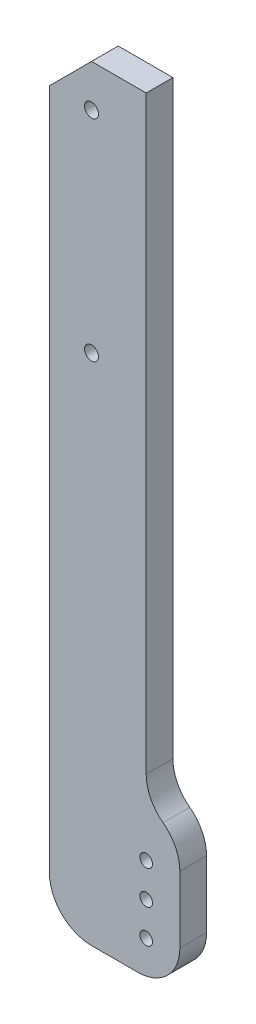
ISO-10303-21;
HEADER;
FILE_DESCRIPTION(('STEP AP214'),'2;1');
FILE_NAME('part.step','',(''),(''),'','','');
FILE_SCHEMA(('AUTOMOTIVE_DESIGN { 1 0 10303 214 1 1 1 1 }'));
ENDSEC;
DATA;
#1=APPLICATION_CONTEXT('core data for automotive mechanical design processes');
#2=APPLICATION_PROTOCOL_DEFINITION('international standard','automotive_design',2000,#1);
#3=PRODUCT_CONTEXT('',#1,'mechanical');
#4=PRODUCT('Part','Part','',(#3));
#5=PRODUCT_RELATED_PRODUCT_CATEGORY('part','',(#4));
#6=PRODUCT_DEFINITION_FORMATION('','',#4);
#7=PRODUCT_DEFINITION_CONTEXT('part definition',#1,'design');
#8=PRODUCT_DEFINITION('design','',#6,#7);
#9=PRODUCT_DEFINITION_SHAPE('','',#8);
#10=(LENGTH_UNIT() NAMED_UNIT(*) SI_UNIT(.MILLI.,.METRE.));
#11=(NAMED_UNIT(*) PLANE_ANGLE_UNIT() SI_UNIT($,.RADIAN.));
#12=(NAMED_UNIT(*) SI_UNIT($,.STERADIAN.) SOLID_ANGLE_UNIT());
#13=UNCERTAINTY_MEASURE_WITH_UNIT(LENGTH_MEASURE(1.E-05),#10,'distance_accuracy_value','');
#14=(GEOMETRIC_REPRESENTATION_CONTEXT(3) GLOBAL_UNCERTAINTY_ASSIGNED_CONTEXT((#13)) GLOBAL_UNIT_ASSIGNED_CONTEXT((#10,
#11,#12)) REPRESENTATION_CONTEXT('',''));
#15=CARTESIAN_POINT('',(0.,0.,0.));
#16=DIRECTION('',(0.,0.,1.));
#17=DIRECTION('',(1.,0.,0.));
#18=AXIS2_PLACEMENT_3D('',#15,#16,#17);
#19=CARTESIAN_POINT('',(8.,0.,6.35));
#20=DIRECTION('',(1.,0.,0.));
#21=DIRECTION('',(0.,0.,-1.));
#22=AXIS2_PLACEMENT_3D('',#19,#20,#21);
#23=PLANE('',#22);
#24=DIRECTION('',(0.,-1.,0.));
#25=VECTOR('',#24,1.);
#26=CARTESIAN_POINT('',(8.,0.,0.));
#27=LINE('',#26,#25);
#28=CARTESIAN_POINT('',(8.,9.79795897113271,0.));
#29=VERTEX_POINT('',#28);
#30=CARTESIAN_POINT('',(8.,-6.,0.));
#31=VERTEX_POINT('',#30);
#32=EDGE_CURVE('E254',#29,#31,#27,.T.);
#33=ORIENTED_EDGE('',*,*,#32,.F.);
#34=DIRECTION('',(0.,0.,1.));
#35=VECTOR('',#34,1.);
#36=CARTESIAN_POINT('',(8.,9.79795897113271,6.35));
#37=LINE('',#36,#35);
#38=CARTESIAN_POINT('',(8.,9.79795897113271,6.35));
#39=VERTEX_POINT('',#38);
#40=EDGE_CURVE('E194',#29,#39,#37,.T.);
#41=ORIENTED_EDGE('',*,*,#40,.T.);
#42=DIRECTION('',(0.,-1.,0.));
#43=VECTOR('',#42,1.);
#44=CARTESIAN_POINT('',(8.,0.,6.35));
#45=LINE('',#44,#43);
#46=CARTESIAN_POINT('',(8.,-6.,6.35));
#47=VERTEX_POINT('',#46);
#48=EDGE_CURVE('E130',#39,#47,#45,.T.);
#49=ORIENTED_EDGE('',*,*,#48,.T.);
#50=DIRECTION('',(0.,0.,-1.));
#51=VECTOR('',#50,1.);
#52=CARTESIAN_POINT('',(8.,-6.,0.));
#53=LINE('',#52,#51);
#54=EDGE_CURVE('E142',#47,#31,#53,.T.);
#55=ORIENTED_EDGE('',*,*,#54,.T.);
#56=EDGE_LOOP('',(#33,#41,#49,#55));
#57=FACE_BOUND('',#56,.T.);
#58=ADVANCED_FACE('F40',(#57),#23,.T.);
#59=CARTESIAN_POINT('',(0.,0.,6.35));
#60=DIRECTION('',(-1.,0.,0.));
#61=DIRECTION('',(0.,0.,1.));
#62=AXIS2_PLACEMENT_3D('',#59,#60,#61);
#63=PLANE('',#62);
#64=DIRECTION('',(0.,1.,0.));
#65=VECTOR('',#64,1.);
#66=CARTESIAN_POINT('',(0.,0.,6.35));
#67=LINE('',#66,#65);
#68=CARTESIAN_POINT('',(0.,25.7979589711327,6.35));
#69=VERTEX_POINT('',#68);
#70=CARTESIAN_POINT('',(0.,166.,6.35));
#71=VERTEX_POINT('',#70);
#72=EDGE_CURVE('E119',#69,#71,#67,.T.);
#73=ORIENTED_EDGE('',*,*,#72,.F.);
#74=DIRECTION('',(0.,0.,-1.));
#75=VECTOR('',#74,1.);
#76=CARTESIAN_POINT('',(0.,25.7979589711327,6.35));
#77=LINE('',#76,#75);
#78=CARTESIAN_POINT('',(0.,25.7979589711327,0.));
#79=VERTEX_POINT('',#78);
#80=EDGE_CURVE('E178',#69,#79,#77,.T.);
#81=ORIENTED_EDGE('',*,*,#80,.T.);
#82=DIRECTION('',(0.,1.,0.));
#83=VECTOR('',#82,1.);
#84=CARTESIAN_POINT('',(0.,0.,0.));
#85=LINE('',#84,#83);
#86=CARTESIAN_POINT('',(0.,166.,0.));
#87=VERTEX_POINT('',#86);
#88=EDGE_CURVE('E140',#79,#87,#85,.T.);
#89=ORIENTED_EDGE('',*,*,#88,.T.);
#90=DIRECTION('',(0.,0.,-1.));
#91=VECTOR('',#90,1.);
#92=CARTESIAN_POINT('',(0.,166.,6.35));
#93=LINE('',#92,#91);
#94=EDGE_CURVE('E134',#71,#87,#93,.T.);
#95=ORIENTED_EDGE('',*,*,#94,.F.);
#96=EDGE_LOOP('',(#73,#81,#89,#95));
#97=FACE_BOUND('',#96,.T.);
#98=ADVANCED_FACE('F138',(#97),#63,.F.);
#99=CARTESIAN_POINT('',(0.,166.,6.35));
#100=DIRECTION('',(0.,-1.,0.));
#101=DIRECTION('',(0.,0.,-1.));
#102=AXIS2_PLACEMENT_3D('',#99,#100,#101);
#103=PLANE('',#102);
#104=DIRECTION('',(-1.,0.,0.));
#105=VECTOR('',#104,1.);
#106=CARTESIAN_POINT('',(0.,166.,0.));
#107=LINE('',#106,#105);
#108=CARTESIAN_POINT('',(-13.,166.,0.));
#109=VERTEX_POINT('',#108);
#110=EDGE_CURVE('E259',#87,#109,#107,.T.);
#111=ORIENTED_EDGE('',*,*,#110,.T.);
#112=DIRECTION('',(0.,0.,1.));
#113=VECTOR('',#112,1.);
#114=CARTESIAN_POINT('',(-13.,166.,6.35));
#115=LINE('',#114,#113);
#116=CARTESIAN_POINT('',(-13.,166.,6.35));
#117=VERTEX_POINT('',#116);
#118=EDGE_CURVE('E50',#109,#117,#115,.T.);
#119=ORIENTED_EDGE('',*,*,#118,.T.);
#120=DIRECTION('',(-1.,0.,0.));
#121=VECTOR('',#120,1.);
#122=CARTESIAN_POINT('',(0.,166.,6.35));
#123=LINE('',#122,#121);
#124=EDGE_CURVE('E121',#71,#117,#123,.T.);
#125=ORIENTED_EDGE('',*,*,#124,.F.);
#126=ORIENTED_EDGE('',*,*,#94,.T.);
#127=EDGE_LOOP('',(#111,#119,#125,#126));
#128=FACE_BOUND('',#127,.T.);
#129=ADVANCED_FACE('F133',(#128),#103,.F.);
#130=CARTESIAN_POINT('',(-23.,0.,6.35));
#131=DIRECTION('',(-1.,0.,0.));
#132=DIRECTION('',(0.,0.,1.));
#133=AXIS2_PLACEMENT_3D('',#130,#131,#132);
#134=PLANE('',#133);
#135=DIRECTION('',(0.,1.,0.));
#136=VECTOR('',#135,1.);
#137=CARTESIAN_POINT('',(-23.,0.,6.35));
#138=LINE('',#137,#136);
#139=CARTESIAN_POINT('',(-23.,-5.99999999999999,6.35));
#140=VERTEX_POINT('',#139);
#141=CARTESIAN_POINT('',(-23.,156.,6.35));
#142=VERTEX_POINT('',#141);
#143=EDGE_CURVE('E136',#140,#142,#138,.T.);
#144=ORIENTED_EDGE('',*,*,#143,.T.);
#145=DIRECTION('',(0.,0.,-1.));
#146=VECTOR('',#145,1.);
#147=CARTESIAN_POINT('',(-23.,156.,0.));
#148=LINE('',#147,#146);
#149=CARTESIAN_POINT('',(-23.,156.,0.));
#150=VERTEX_POINT('',#149);
#151=EDGE_CURVE('E200',#142,#150,#148,.T.);
#152=ORIENTED_EDGE('',*,*,#151,.T.);
#153=DIRECTION('',(0.,1.,0.));
#154=VECTOR('',#153,1.);
#155=CARTESIAN_POINT('',(-23.,0.,0.));
#156=LINE('',#155,#154);
#157=CARTESIAN_POINT('',(-23.,-5.99999999999999,0.));
#158=VERTEX_POINT('',#157);
#159=EDGE_CURVE('E261',#158,#150,#156,.T.);
#160=ORIENTED_EDGE('',*,*,#159,.F.);
#161=DIRECTION('',(0.,0.,-1.));
#162=VECTOR('',#161,1.);
#163=CARTESIAN_POINT('',(-23.,-5.99999999999999,6.35));
#164=LINE('',#163,#162);
#165=EDGE_CURVE('E175',#158,#140,#164,.F.);
#166=ORIENTED_EDGE('',*,*,#165,.T.);
#167=EDGE_LOOP('',(#144,#152,#160,#166));
#168=FACE_BOUND('',#167,.T.);
#169=ADVANCED_FACE('F286',(#168),#134,.T.);
#170=CARTESIAN_POINT('',(0.,0.,6.35));
#171=DIRECTION('',(0.,0.,-1.));
#172=DIRECTION('',(-1.,0.,0.));
#173=AXIS2_PLACEMENT_3D('',#170,#171,#172);
#174=CYLINDRICAL_SURFACE('',#173,1.5);
#175=CARTESIAN_POINT('',(0.,0.,6.35));
#176=DIRECTION('',(0.,0.,1.));
#177=DIRECTION('',(1.,0.,0.));
#178=AXIS2_PLACEMENT_3D('',#175,#176,#177);
#179=CIRCLE('',#178,1.5);
#180=CARTESIAN_POINT('',(1.5,0.,6.35));
#181=VERTEX_POINT('',#180);
#182=EDGE_CURVE('E234',#181,#181,#179,.T.);
#183=ORIENTED_EDGE('',*,*,#182,.T.);
#184=EDGE_LOOP('',(#183));
#185=FACE_BOUND('',#184,.T.);
#186=CARTESIAN_POINT('',(0.,0.,0.));
#187=DIRECTION('',(0.,0.,1.));
#188=DIRECTION('',(1.,0.,0.));
#189=AXIS2_PLACEMENT_3D('',#186,#187,#188);
#190=CIRCLE('',#189,1.5);
#191=CARTESIAN_POINT('',(1.5,0.,0.));
#192=VERTEX_POINT('',#191);
#193=EDGE_CURVE('E250',#192,#192,#190,.T.);
#194=ORIENTED_EDGE('',*,*,#193,.F.);
#195=EDGE_LOOP('',(#194));
#196=FACE_BOUND('',#195,.T.);
#197=ADVANCED_FACE('F311',(#185,#196),#174,.F.);
#198=CARTESIAN_POINT('',(0.,8.,6.35));
#199=DIRECTION('',(0.,0.,-1.));
#200=DIRECTION('',(-1.,0.,0.));
#201=AXIS2_PLACEMENT_3D('',#198,#199,#200);
#202=CYLINDRICAL_SURFACE('',#201,1.5);
#203=CARTESIAN_POINT('',(0.,8.,6.35));
#204=DIRECTION('',(0.,0.,1.));
#205=DIRECTION('',(1.,0.,0.));
#206=AXIS2_PLACEMENT_3D('',#203,#204,#205);
#207=CIRCLE('',#206,1.5);
#208=CARTESIAN_POINT('',(1.5,8.,6.35));
#209=VERTEX_POINT('',#208);
#210=EDGE_CURVE('E230',#209,#209,#207,.T.);
#211=ORIENTED_EDGE('',*,*,#210,.T.);
#212=EDGE_LOOP('',(#211));
#213=FACE_BOUND('',#212,.T.);
#214=CARTESIAN_POINT('',(0.,8.,0.));
#215=DIRECTION('',(0.,0.,1.));
#216=DIRECTION('',(1.,0.,0.));
#217=AXIS2_PLACEMENT_3D('',#214,#215,#216);
#218=CIRCLE('',#217,1.5);
#219=CARTESIAN_POINT('',(1.5,8.,0.));
#220=VERTEX_POINT('',#219);
#221=EDGE_CURVE('E246',#220,#220,#218,.T.);
#222=ORIENTED_EDGE('',*,*,#221,.F.);
#223=EDGE_LOOP('',(#222));
#224=FACE_BOUND('',#223,.T.);
#225=ADVANCED_FACE('F314',(#213,#224),#202,.F.);
#226=CARTESIAN_POINT('',(0.,-8.,6.35));
#227=DIRECTION('',(0.,0.,-1.));
#228=DIRECTION('',(-1.,0.,0.));
#229=AXIS2_PLACEMENT_3D('',#226,#227,#228);
#230=CYLINDRICAL_SURFACE('',#229,1.5);
#231=CARTESIAN_POINT('',(0.,-8.,6.35));
#232=DIRECTION('',(0.,0.,1.));
#233=DIRECTION('',(1.,0.,0.));
#234=AXIS2_PLACEMENT_3D('',#231,#232,#233);
#235=CIRCLE('',#234,1.5);
#236=CARTESIAN_POINT('',(1.5,-8.,6.35));
#237=VERTEX_POINT('',#236);
#238=EDGE_CURVE('E226',#237,#237,#235,.T.);
#239=ORIENTED_EDGE('',*,*,#238,.T.);
#240=EDGE_LOOP('',(#239));
#241=FACE_BOUND('',#240,.T.);
#242=CARTESIAN_POINT('',(0.,-8.,0.));
#243=DIRECTION('',(0.,0.,1.));
#244=DIRECTION('',(1.,0.,0.));
#245=AXIS2_PLACEMENT_3D('',#242,#243,#244);
#246=CIRCLE('',#245,1.5);
#247=CARTESIAN_POINT('',(1.5,-8.,0.));
#248=VERTEX_POINT('',#247);
#249=EDGE_CURVE('E216',#248,#248,#246,.T.);
#250=ORIENTED_EDGE('',*,*,#249,.F.);
#251=EDGE_LOOP('',(#250));
#252=FACE_BOUND('',#251,.T.);
#253=ADVANCED_FACE('F318',(#241,#252),#230,.F.);
#254=CARTESIAN_POINT('',(0.,-16.,6.35));
#255=DIRECTION('',(0.,1.,0.));
#256=DIRECTION('',(-1.,0.,0.));
#257=AXIS2_PLACEMENT_3D('',#254,#255,#256);
#258=PLANE('',#257);
#259=DIRECTION('',(1.,0.,0.));
#260=VECTOR('',#259,1.);
#261=CARTESIAN_POINT('',(0.,-16.,0.));
#262=LINE('',#261,#260);
#263=CARTESIAN_POINT('',(-13.,-16.,0.));
#264=VERTEX_POINT('',#263);
#265=CARTESIAN_POINT('',(-2.,-16.,0.));
#266=VERTEX_POINT('',#265);
#267=EDGE_CURVE('E153',#264,#266,#262,.T.);
#268=ORIENTED_EDGE('',*,*,#267,.T.);
#269=DIRECTION('',(0.,0.,-1.));
#270=VECTOR('',#269,1.);
#271=CARTESIAN_POINT('',(-2.,-16.,6.35));
#272=LINE('',#271,#270);
#273=CARTESIAN_POINT('',(-2.,-16.,6.35));
#274=VERTEX_POINT('',#273);
#275=EDGE_CURVE('E165',#266,#274,#272,.F.);
#276=ORIENTED_EDGE('',*,*,#275,.T.);
#277=DIRECTION('',(1.,0.,0.));
#278=VECTOR('',#277,1.);
#279=CARTESIAN_POINT('',(0.,-16.,6.35));
#280=LINE('',#279,#278);
#281=CARTESIAN_POINT('',(-13.,-16.,6.35));
#282=VERTEX_POINT('',#281);
#283=EDGE_CURVE('E143',#282,#274,#280,.T.);
#284=ORIENTED_EDGE('',*,*,#283,.F.);
#285=DIRECTION('',(0.,0.,-1.));
#286=VECTOR('',#285,1.);
#287=CARTESIAN_POINT('',(-13.,-16.,0.));
#288=LINE('',#287,#286);
#289=EDGE_CURVE('E161',#282,#264,#288,.T.);
#290=ORIENTED_EDGE('',*,*,#289,.T.);
#291=EDGE_LOOP('',(#268,#276,#284,#290));
#292=FACE_BOUND('',#291,.T.);
#293=ADVANCED_FACE('F269',(#292),#258,.F.);
#294=CARTESIAN_POINT('',(0.,0.,6.35));
#295=DIRECTION('',(0.,0.,1.));
#296=DIRECTION('',(1.,0.,0.));
#297=AXIS2_PLACEMENT_3D('',#294,#295,#296);
#298=PLANE('',#297);
#299=CARTESIAN_POINT('',(-13.,156.,6.35));
#300=DIRECTION('',(0.,0.,1.));
#301=DIRECTION('',(1.,0.,0.));
#302=AXIS2_PLACEMENT_3D('',#299,#300,#301);
#303=CIRCLE('',#302,1.65000000000002);
#304=CARTESIAN_POINT('',(-11.3499999999999,156.,6.35));
#305=VERTEX_POINT('',#304);
#306=EDGE_CURVE('E210',#305,#305,#303,.T.);
#307=ORIENTED_EDGE('',*,*,#306,.F.);
#308=EDGE_LOOP('',(#307));
#309=FACE_BOUND('',#308,.T.);
#310=CARTESIAN_POINT('',(-13.,106.,6.35));
#311=DIRECTION('',(0.,0.,1.));
#312=DIRECTION('',(1.,0.,0.));
#313=AXIS2_PLACEMENT_3D('',#310,#311,#312);
#314=CIRCLE('',#313,1.65);
#315=CARTESIAN_POINT('',(-11.35,106.,6.35));
#316=VERTEX_POINT('',#315);
#317=EDGE_CURVE('E218',#316,#316,#314,.T.);
#318=ORIENTED_EDGE('',*,*,#317,.F.);
#319=EDGE_LOOP('',(#318));
#320=FACE_BOUND('',#319,.T.);
#321=ORIENTED_EDGE('',*,*,#238,.F.);
#322=EDGE_LOOP('',(#321));
#323=FACE_BOUND('',#322,.T.);
#324=ORIENTED_EDGE('',*,*,#210,.F.);
#325=EDGE_LOOP('',(#324));
#326=FACE_BOUND('',#325,.T.);
#327=ORIENTED_EDGE('',*,*,#182,.F.);
#328=EDGE_LOOP('',(#327));
#329=FACE_BOUND('',#328,.T.);
#330=ORIENTED_EDGE('',*,*,#124,.T.);
#331=DIRECTION('',(-0.707106781186549,-0.707106781186547,0.));
#332=VECTOR('',#331,1.);
#333=CARTESIAN_POINT('',(-89.5,89.5000000000002,6.35));
#334=LINE('',#333,#332);
#335=EDGE_CURVE('E11',#117,#142,#334,.T.);
#336=ORIENTED_EDGE('',*,*,#335,.T.);
#337=ORIENTED_EDGE('',*,*,#143,.F.);
#338=CARTESIAN_POINT('',(-13.,-5.99999999999999,6.35));
#339=DIRECTION('',(0.,0.,1.));
#340=DIRECTION('',(1.,0.,0.));
#341=AXIS2_PLACEMENT_3D('',#338,#339,#340);
#342=CIRCLE('',#341,10.);
#343=EDGE_CURVE('E168',#140,#282,#342,.T.);
#344=ORIENTED_EDGE('',*,*,#343,.T.);
#345=ORIENTED_EDGE('',*,*,#283,.T.);
#346=CARTESIAN_POINT('',(-2.,-6.,6.35));
#347=DIRECTION('',(0.,0.,1.));
#348=DIRECTION('',(1.,0.,0.));
#349=AXIS2_PLACEMENT_3D('',#346,#347,#348);
#350=CIRCLE('',#349,10.);
#351=EDGE_CURVE('E171',#274,#47,#350,.T.);
#352=ORIENTED_EDGE('',*,*,#351,.T.);
#353=ORIENTED_EDGE('',*,*,#48,.F.);
#354=CARTESIAN_POINT('',(-2.,9.79795897113271,6.35));
#355=DIRECTION('',(0.,0.,1.));
#356=DIRECTION('',(1.,0.,0.));
#357=AXIS2_PLACEMENT_3D('',#354,#355,#356);
#358=CIRCLE('',#357,10.);
#359=CARTESIAN_POINT('',(4.,17.7979589711327,6.35));
#360=VERTEX_POINT('',#359);
#361=EDGE_CURVE('E197',#39,#360,#358,.T.);
#362=ORIENTED_EDGE('',*,*,#361,.T.);
#363=CARTESIAN_POINT('',(10.,25.7979589711327,6.35));
#364=DIRECTION('',(0.,0.,1.));
#365=DIRECTION('',(1.,0.,0.));
#366=AXIS2_PLACEMENT_3D('',#363,#364,#365);
#367=CIRCLE('',#366,10.);
#368=EDGE_CURVE('E124',#360,#69,#367,.F.);
#369=ORIENTED_EDGE('',*,*,#368,.T.);
#370=ORIENTED_EDGE('',*,*,#72,.T.);
#371=EDGE_LOOP('',(#330,#336,#337,#344,#345,#352,#353,#362,#369,#370));
#372=FACE_BOUND('',#371,.T.);
#373=ADVANCED_FACE('F120',(#309,#320,#323,#326,#329,#372),#298,.T.);
#374=CARTESIAN_POINT('',(0.,0.,0.));
#375=DIRECTION('',(0.,0.,1.));
#376=DIRECTION('',(1.,0.,0.));
#377=AXIS2_PLACEMENT_3D('',#374,#375,#376);
#378=PLANE('',#377);
#379=CARTESIAN_POINT('',(-13.,156.,0.));
#380=DIRECTION('',(0.,0.,1.));
#381=DIRECTION('',(1.,0.,0.));
#382=AXIS2_PLACEMENT_3D('',#379,#380,#381);
#383=CIRCLE('',#382,1.65000000000002);
#384=CARTESIAN_POINT('',(-11.3499999999999,156.,0.));
#385=VERTEX_POINT('',#384);
#386=EDGE_CURVE('E44',#385,#385,#383,.T.);
#387=ORIENTED_EDGE('',*,*,#386,.T.);
#388=EDGE_LOOP('',(#387));
#389=FACE_BOUND('',#388,.T.);
#390=CARTESIAN_POINT('',(-13.,106.,0.));
#391=DIRECTION('',(0.,0.,1.));
#392=DIRECTION('',(1.,0.,0.));
#393=AXIS2_PLACEMENT_3D('',#390,#391,#392);
#394=CIRCLE('',#393,1.65);
#395=CARTESIAN_POINT('',(-11.35,106.,0.));
#396=VERTEX_POINT('',#395);
#397=EDGE_CURVE('E207',#396,#396,#394,.T.);
#398=ORIENTED_EDGE('',*,*,#397,.T.);
#399=EDGE_LOOP('',(#398));
#400=FACE_BOUND('',#399,.T.);
#401=ORIENTED_EDGE('',*,*,#249,.T.);
#402=EDGE_LOOP('',(#401));
#403=FACE_BOUND('',#402,.T.);
#404=ORIENTED_EDGE('',*,*,#221,.T.);
#405=EDGE_LOOP('',(#404));
#406=FACE_BOUND('',#405,.T.);
#407=ORIENTED_EDGE('',*,*,#193,.T.);
#408=EDGE_LOOP('',(#407));
#409=FACE_BOUND('',#408,.T.);
#410=ORIENTED_EDGE('',*,*,#159,.T.);
#411=DIRECTION('',(0.707106781186549,0.707106781186547,0.));
#412=VECTOR('',#411,1.);
#413=CARTESIAN_POINT('',(-23.,156.,0.));
#414=LINE('',#413,#412);
#415=EDGE_CURVE('E65',#150,#109,#414,.T.);
#416=ORIENTED_EDGE('',*,*,#415,.T.);
#417=ORIENTED_EDGE('',*,*,#110,.F.);
#418=ORIENTED_EDGE('',*,*,#88,.F.);
#419=CARTESIAN_POINT('',(10.,25.7979589711327,0.));
#420=DIRECTION('',(0.,0.,1.));
#421=DIRECTION('',(1.,0.,0.));
#422=AXIS2_PLACEMENT_3D('',#419,#420,#421);
#423=CIRCLE('',#422,10.);
#424=CARTESIAN_POINT('',(4.,17.7979589711327,0.));
#425=VERTEX_POINT('',#424);
#426=EDGE_CURVE('E181',#79,#425,#423,.T.);
#427=ORIENTED_EDGE('',*,*,#426,.T.);
#428=CARTESIAN_POINT('',(-2.,9.79795897113271,0.));
#429=DIRECTION('',(0.,0.,1.));
#430=DIRECTION('',(1.,0.,0.));
#431=AXIS2_PLACEMENT_3D('',#428,#429,#430);
#432=CIRCLE('',#431,10.);
#433=EDGE_CURVE('E191',#425,#29,#432,.F.);
#434=ORIENTED_EDGE('',*,*,#433,.T.);
#435=ORIENTED_EDGE('',*,*,#32,.T.);
#436=CARTESIAN_POINT('',(-2.,-6.,0.));
#437=DIRECTION('',(0.,0.,1.));
#438=DIRECTION('',(1.,0.,0.));
#439=AXIS2_PLACEMENT_3D('',#436,#437,#438);
#440=CIRCLE('',#439,10.);
#441=EDGE_CURVE('E158',#31,#266,#440,.F.);
#442=ORIENTED_EDGE('',*,*,#441,.T.);
#443=ORIENTED_EDGE('',*,*,#267,.F.);
#444=CARTESIAN_POINT('',(-13.,-5.99999999999999,0.));
#445=DIRECTION('',(0.,0.,1.));
#446=DIRECTION('',(1.,0.,0.));
#447=AXIS2_PLACEMENT_3D('',#444,#445,#446);
#448=CIRCLE('',#447,10.);
#449=EDGE_CURVE('E148',#264,#158,#448,.F.);
#450=ORIENTED_EDGE('',*,*,#449,.T.);
#451=EDGE_LOOP('',(#410,#416,#417,#418,#427,#434,#435,#442,#443,#450));
#452=FACE_BOUND('',#451,.T.);
#453=ADVANCED_FACE('F284',(#389,#400,#403,#406,#409,#452),#378,.F.);
#454=CARTESIAN_POINT('',(-2.,-6.,6.35));
#455=DIRECTION('',(0.,0.,1.));
#456=DIRECTION('',(1.,0.,0.));
#457=AXIS2_PLACEMENT_3D('',#454,#455,#456);
#458=CYLINDRICAL_SURFACE('',#457,10.);
#459=ORIENTED_EDGE('',*,*,#351,.F.);
#460=ORIENTED_EDGE('',*,*,#275,.F.);
#461=ORIENTED_EDGE('',*,*,#441,.F.);
#462=ORIENTED_EDGE('',*,*,#54,.F.);
#463=EDGE_LOOP('',(#459,#460,#461,#462));
#464=FACE_BOUND('',#463,.T.);
#465=ADVANCED_FACE('F275',(#464),#458,.T.);
#466=CARTESIAN_POINT('',(-13.,-5.99999999999999,6.35));
#467=DIRECTION('',(0.,0.,1.));
#468=DIRECTION('',(1.,0.,0.));
#469=AXIS2_PLACEMENT_3D('',#466,#467,#468);
#470=CYLINDRICAL_SURFACE('',#469,10.);
#471=ORIENTED_EDGE('',*,*,#343,.F.);
#472=ORIENTED_EDGE('',*,*,#165,.F.);
#473=ORIENTED_EDGE('',*,*,#449,.F.);
#474=ORIENTED_EDGE('',*,*,#289,.F.);
#475=EDGE_LOOP('',(#471,#472,#473,#474));
#476=FACE_BOUND('',#475,.T.);
#477=ADVANCED_FACE('F282',(#476),#470,.T.);
#478=CARTESIAN_POINT('',(10.,25.7979589711327,6.35));
#479=DIRECTION('',(0.,0.,-1.));
#480=DIRECTION('',(-1.,0.,0.));
#481=AXIS2_PLACEMENT_3D('',#478,#479,#480);
#482=CYLINDRICAL_SURFACE('',#481,10.);
#483=ORIENTED_EDGE('',*,*,#368,.F.);
#484=DIRECTION('',(0.,0.,-1.));
#485=VECTOR('',#484,1.);
#486=CARTESIAN_POINT('',(4.,17.7979589711327,6.35));
#487=LINE('',#486,#485);
#488=EDGE_CURVE('E187',#360,#425,#487,.T.);
#489=ORIENTED_EDGE('',*,*,#488,.T.);
#490=ORIENTED_EDGE('',*,*,#426,.F.);
#491=ORIENTED_EDGE('',*,*,#80,.F.);
#492=EDGE_LOOP('',(#483,#489,#490,#491));
#493=FACE_BOUND('',#492,.T.);
#494=ADVANCED_FACE('F299',(#493),#482,.F.);
#495=CARTESIAN_POINT('',(-2.,9.79795897113271,6.35));
#496=DIRECTION('',(0.,0.,-1.));
#497=DIRECTION('',(-1.,0.,0.));
#498=AXIS2_PLACEMENT_3D('',#495,#496,#497);
#499=CYLINDRICAL_SURFACE('',#498,10.);
#500=ORIENTED_EDGE('',*,*,#361,.F.);
#501=ORIENTED_EDGE('',*,*,#40,.F.);
#502=ORIENTED_EDGE('',*,*,#433,.F.);
#503=ORIENTED_EDGE('',*,*,#488,.F.);
#504=EDGE_LOOP('',(#500,#501,#502,#503));
#505=FACE_BOUND('',#504,.T.);
#506=ADVANCED_FACE('F291',(#505),#499,.T.);
#507=CARTESIAN_POINT('',(-23.,156.,6.35));
#508=DIRECTION('',(-0.707106781186547,0.707106781186549,0.));
#509=DIRECTION('',(0.,0.,1.));
#510=AXIS2_PLACEMENT_3D('',#507,#508,#509);
#511=PLANE('',#510);
#512=ORIENTED_EDGE('',*,*,#335,.F.);
#513=ORIENTED_EDGE('',*,*,#118,.F.);
#514=ORIENTED_EDGE('',*,*,#415,.F.);
#515=ORIENTED_EDGE('',*,*,#151,.F.);
#516=EDGE_LOOP('',(#512,#513,#514,#515));
#517=FACE_BOUND('',#516,.T.);
#518=ADVANCED_FACE('F42',(#517),#511,.T.);
#519=CARTESIAN_POINT('',(-13.,106.,-3.65));
#520=DIRECTION('',(0.,0.,1.));
#521=DIRECTION('',(1.,0.,0.));
#522=AXIS2_PLACEMENT_3D('',#519,#520,#521);
#523=CYLINDRICAL_SURFACE('',#522,1.65);
#524=ORIENTED_EDGE('',*,*,#317,.T.);
#525=EDGE_LOOP('',(#524));
#526=FACE_BOUND('',#525,.T.);
#527=ORIENTED_EDGE('',*,*,#397,.F.);
#528=EDGE_LOOP('',(#527));
#529=FACE_BOUND('',#528,.T.);
#530=ADVANCED_FACE('F290',(#526,#529),#523,.F.);
#531=CARTESIAN_POINT('',(-13.,156.,-3.65));
#532=DIRECTION('',(0.,0.,1.));
#533=DIRECTION('',(1.,0.,0.));
#534=AXIS2_PLACEMENT_3D('',#531,#532,#533);
#535=CYLINDRICAL_SURFACE('',#534,1.65000000000002);
#536=ORIENTED_EDGE('',*,*,#306,.T.);
#537=EDGE_LOOP('',(#536));
#538=FACE_BOUND('',#537,.T.);
#539=ORIENTED_EDGE('',*,*,#386,.F.);
#540=EDGE_LOOP('',(#539));
#541=FACE_BOUND('',#540,.T.);
#542=ADVANCED_FACE('F296',(#538,#541),#535,.F.);
#543=CLOSED_SHELL('',(#58,#98,#129,#169,#197,#225,#253,#293,#373,#453,#465,#477,#494,#506,#518,
#530,#542));
#544=MANIFOLD_SOLID_BREP('B2',#543);
#545=ADVANCED_BREP_SHAPE_REPRESENTATION('',(#18,#544),#14);
#546=SHAPE_DEFINITION_REPRESENTATION(#9,#545);
ENDSEC;
END-ISO-10303-21;
